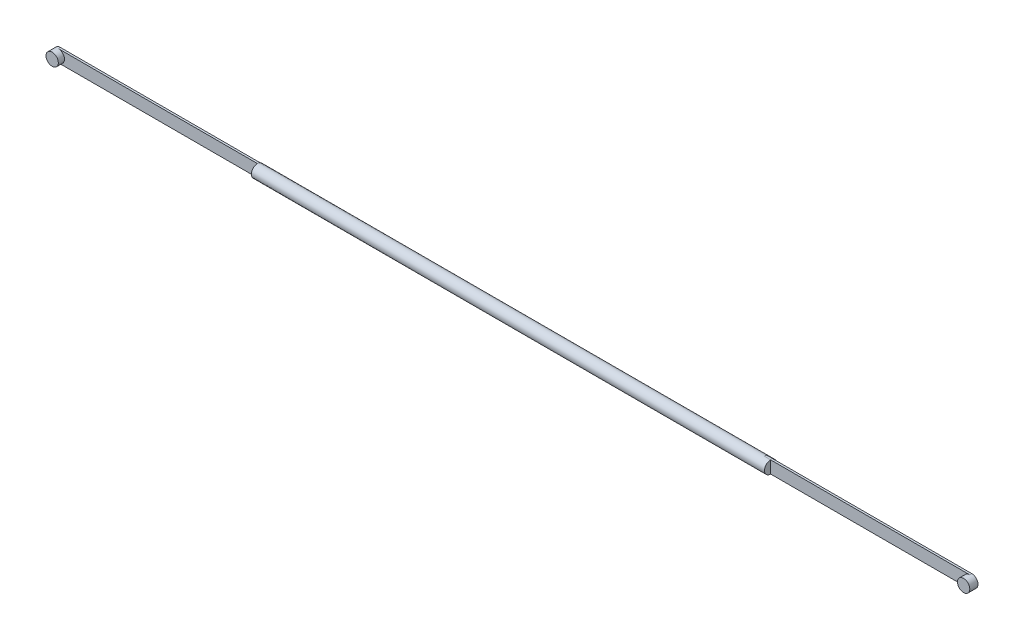
ISO-10303-21;
HEADER;
FILE_DESCRIPTION(('STEP AP214'),'2;1');
FILE_NAME('part.step','',(''),(''),'','','');
FILE_SCHEMA(('AUTOMOTIVE_DESIGN { 1 0 10303 214 1 1 1 1 }'));
ENDSEC;
DATA;
#1=APPLICATION_CONTEXT('core data for automotive mechanical design processes');
#2=APPLICATION_PROTOCOL_DEFINITION('international standard','automotive_design',2000,#1);
#3=PRODUCT_CONTEXT('',#1,'mechanical');
#4=PRODUCT('Part','Part','',(#3));
#5=PRODUCT_RELATED_PRODUCT_CATEGORY('part','',(#4));
#6=PRODUCT_DEFINITION_FORMATION('','',#4);
#7=PRODUCT_DEFINITION_CONTEXT('part definition',#1,'design');
#8=PRODUCT_DEFINITION('design','',#6,#7);
#9=PRODUCT_DEFINITION_SHAPE('','',#8);
#10=(LENGTH_UNIT() NAMED_UNIT(*) SI_UNIT(.MILLI.,.METRE.));
#11=(NAMED_UNIT(*) PLANE_ANGLE_UNIT() SI_UNIT($,.RADIAN.));
#12=(NAMED_UNIT(*) SI_UNIT($,.STERADIAN.) SOLID_ANGLE_UNIT());
#13=UNCERTAINTY_MEASURE_WITH_UNIT(LENGTH_MEASURE(1.E-05),#10,'distance_accuracy_value','');
#14=(GEOMETRIC_REPRESENTATION_CONTEXT(3) GLOBAL_UNCERTAINTY_ASSIGNED_CONTEXT((#13)) GLOBAL_UNIT_ASSIGNED_CONTEXT((#10,
#11,#12)) REPRESENTATION_CONTEXT('',''));
#15=CARTESIAN_POINT('',(0.,0.,0.));
#16=DIRECTION('',(0.,0.,1.));
#17=DIRECTION('',(1.,0.,0.));
#18=AXIS2_PLACEMENT_3D('',#15,#16,#17);
#19=CARTESIAN_POINT('',(-125.,0.,0.));
#20=DIRECTION('',(1.,0.,0.));
#21=DIRECTION('',(0.,1.,0.));
#22=AXIS2_PLACEMENT_3D('',#19,#20,#21);
#23=PLANE('',#22);
#24=DIRECTION('',(0.,-1.,0.));
#25=VECTOR('',#24,1.);
#26=CARTESIAN_POINT('',(-125.,0.,-1.));
#27=LINE('',#26,#25);
#28=CARTESIAN_POINT('',(-125.,2.82842712474632,-1.));
#29=VERTEX_POINT('',#28);
#30=CARTESIAN_POINT('',(-125.,-2.82842712474632,-1.));
#31=VERTEX_POINT('',#30);
#32=EDGE_CURVE('E234',#29,#31,#27,.T.);
#33=ORIENTED_EDGE('',*,*,#32,.F.);
#34=CARTESIAN_POINT('',(-125.,0.,0.));
#35=DIRECTION('',(-1.,0.,0.));
#36=DIRECTION('',(0.,-1.,0.));
#37=AXIS2_PLACEMENT_3D('',#34,#35,#36);
#38=CIRCLE('',#37,3.00000000000012);
#39=EDGE_CURVE('E192',#29,#31,#38,.T.);
#40=ORIENTED_EDGE('',*,*,#39,.T.);
#41=EDGE_LOOP('',(#33,#40));
#42=FACE_BOUND('',#41,.T.);
#43=ADVANCED_FACE('F47',(#42),#23,.F.);
#44=CARTESIAN_POINT('',(125.,0.,0.));
#45=DIRECTION('',(1.,0.,0.));
#46=DIRECTION('',(0.,1.,0.));
#47=AXIS2_PLACEMENT_3D('',#44,#45,#46);
#48=PLANE('',#47);
#49=CARTESIAN_POINT('',(125.,0.,0.));
#50=DIRECTION('',(-1.,0.,0.));
#51=DIRECTION('',(0.,-1.,0.));
#52=AXIS2_PLACEMENT_3D('',#49,#50,#51);
#53=CIRCLE('',#52,3.0000000000001);
#54=CARTESIAN_POINT('',(125.,2.82842712474633,-1.));
#55=VERTEX_POINT('',#54);
#56=CARTESIAN_POINT('',(125.,-2.82842712474628,-1.));
#57=VERTEX_POINT('',#56);
#58=EDGE_CURVE('E178',#55,#57,#53,.T.);
#59=ORIENTED_EDGE('',*,*,#58,.F.);
#60=DIRECTION('',(0.,-1.,0.));
#61=VECTOR('',#60,1.);
#62=CARTESIAN_POINT('',(125.,0.,-1.));
#63=LINE('',#62,#61);
#64=EDGE_CURVE('E189',#55,#57,#63,.T.);
#65=ORIENTED_EDGE('',*,*,#64,.T.);
#66=EDGE_LOOP('',(#59,#65));
#67=FACE_BOUND('',#66,.T.);
#68=ADVANCED_FACE('F262',(#67),#48,.T.);
#69=CARTESIAN_POINT('',(-125.,0.,0.));
#70=DIRECTION('',(-1.,0.,0.));
#71=DIRECTION('',(0.,-1.,0.));
#72=AXIS2_PLACEMENT_3D('',#69,#70,#71);
#73=CYLINDRICAL_SURFACE('',#72,3.00000000000011);
#74=CARTESIAN_POINT('',(-125.,-3.00000000000018,0.));
#75=VERTEX_POINT('',#74);
#76=CARTESIAN_POINT('',(-125.,3.00000000000018,0.));
#77=VERTEX_POINT('',#76);
#78=EDGE_CURVE('E183',#75,#77,#38,.T.);
#79=ORIENTED_EDGE('',*,*,#78,.F.);
#80=EDGE_CURVE('E187',#31,#75,#38,.T.);
#81=ORIENTED_EDGE('',*,*,#80,.F.);
#82=ORIENTED_EDGE('',*,*,#39,.F.);
#83=EDGE_CURVE('E188',#77,#29,#38,.T.);
#84=ORIENTED_EDGE('',*,*,#83,.F.);
#85=EDGE_LOOP('',(#79,#81,#82,#84));
#86=FACE_BOUND('',#85,.T.);
#87=DIRECTION('',(-1.,0.,0.));
#88=VECTOR('',#87,1.);
#89=CARTESIAN_POINT('',(-125.,2.82842712474631,-1.));
#90=LINE('',#89,#88);
#91=CARTESIAN_POINT('',(122.,2.82842712474634,-1.));
#92=VERTEX_POINT('',#91);
#93=EDGE_CURVE('E171',#55,#92,#90,.T.);
#94=ORIENTED_EDGE('',*,*,#93,.F.);
#95=ORIENTED_EDGE('',*,*,#58,.T.);
#96=DIRECTION('',(-1.,0.,0.));
#97=VECTOR('',#96,1.);
#98=CARTESIAN_POINT('',(-125.,-2.82842712474631,-1.));
#99=LINE('',#98,#97);
#100=CARTESIAN_POINT('',(122.,-2.82842712474628,-1.));
#101=VERTEX_POINT('',#100);
#102=EDGE_CURVE('E173',#101,#57,#99,.F.);
#103=ORIENTED_EDGE('',*,*,#102,.F.);
#104=CARTESIAN_POINT('',(122.,0.,0.));
#105=DIRECTION('',(-1.,0.,0.));
#106=DIRECTION('',(0.,0.,1.));
#107=AXIS2_PLACEMENT_3D('',#104,#105,#106);
#108=CIRCLE('',#107,3.00000000000011);
#109=CARTESIAN_POINT('',(122.,-3.00000000000019,0.));
#110=VERTEX_POINT('',#109);
#111=EDGE_CURVE('E175',#101,#110,#108,.T.);
#112=ORIENTED_EDGE('',*,*,#111,.T.);
#113=DIRECTION('',(1.,0.,0.));
#114=VECTOR('',#113,1.);
#115=CARTESIAN_POINT('',(0.,-3.00000000000019,0.));
#116=LINE('',#115,#114);
#117=CARTESIAN_POINT('',(125.,-3.00000000000007,0.));
#118=VERTEX_POINT('',#117);
#119=EDGE_CURVE('E154',#110,#118,#116,.T.);
#120=ORIENTED_EDGE('',*,*,#119,.T.);
#121=CARTESIAN_POINT('',(125.,3.00000000000016,0.));
#122=VERTEX_POINT('',#121);
#123=EDGE_CURVE('E180',#118,#122,#53,.T.);
#124=ORIENTED_EDGE('',*,*,#123,.T.);
#125=DIRECTION('',(1.,0.,0.));
#126=VECTOR('',#125,1.);
#127=CARTESIAN_POINT('',(0.,3.00000000000016,0.));
#128=LINE('',#127,#126);
#129=CARTESIAN_POINT('',(122.,3.00000000000016,0.));
#130=VERTEX_POINT('',#129);
#131=EDGE_CURVE('E199',#130,#122,#128,.T.);
#132=ORIENTED_EDGE('',*,*,#131,.F.);
#133=EDGE_CURVE('E179',#130,#92,#108,.T.);
#134=ORIENTED_EDGE('',*,*,#133,.T.);
#135=EDGE_LOOP('',(#94,#95,#103,#112,#120,#124,#132,#134));
#136=FACE_BOUND('',#135,.T.);
#137=ADVANCED_FACE('F255',(#86,#136),#73,.T.);
#138=DIRECTION('',(0.,-1.,0.));
#139=VECTOR('',#138,1.);
#140=CARTESIAN_POINT('',(125.,0.,0.));
#141=LINE('',#140,#139);
#142=EDGE_CURVE('E150',#122,#118,#141,.T.);
#143=ORIENTED_EDGE('',*,*,#142,.F.);
#144=ORIENTED_EDGE('',*,*,#123,.F.);
#145=EDGE_LOOP('',(#143,#144));
#146=FACE_BOUND('',#145,.T.);
#147=ADVANCED_FACE('F253',(#146),#48,.T.);
#148=ORIENTED_EDGE('',*,*,#78,.T.);
#149=DIRECTION('',(0.,-1.,0.));
#150=VECTOR('',#149,1.);
#151=CARTESIAN_POINT('',(-125.,0.,0.));
#152=LINE('',#151,#150);
#153=EDGE_CURVE('E186',#77,#75,#152,.T.);
#154=ORIENTED_EDGE('',*,*,#153,.T.);
#155=EDGE_LOOP('',(#148,#154));
#156=FACE_BOUND('',#155,.T.);
#157=ADVANCED_FACE('F266',(#156),#23,.F.);
#158=CARTESIAN_POINT('',(122.,0.,-1.));
#159=DIRECTION('',(-1.,0.,0.));
#160=DIRECTION('',(0.,0.,1.));
#161=AXIS2_PLACEMENT_3D('',#158,#159,#160);
#162=PLANE('',#161);
#163=ORIENTED_EDGE('',*,*,#133,.F.);
#164=DIRECTION('',(0.,0.,1.));
#165=VECTOR('',#164,1.);
#166=CARTESIAN_POINT('',(122.,3.00000000000016,-1.));
#167=LINE('',#166,#165);
#168=CARTESIAN_POINT('',(122.,3.00000000000016,-1.));
#169=VERTEX_POINT('',#168);
#170=EDGE_CURVE('E193',#169,#130,#167,.T.);
#171=ORIENTED_EDGE('',*,*,#170,.F.);
#172=DIRECTION('',(0.,-1.,0.));
#173=VECTOR('',#172,1.);
#174=CARTESIAN_POINT('',(122.,0.,-1.));
#175=LINE('',#174,#173);
#176=EDGE_CURVE('E204',#169,#92,#175,.T.);
#177=ORIENTED_EDGE('',*,*,#176,.T.);
#178=EDGE_LOOP('',(#163,#171,#177));
#179=FACE_BOUND('',#178,.T.);
#180=ADVANCED_FACE('F264',(#179),#162,.T.);
#181=CARTESIAN_POINT('',(0.,0.,-1.));
#182=DIRECTION('',(0.,0.,1.));
#183=DIRECTION('',(1.,0.,0.));
#184=AXIS2_PLACEMENT_3D('',#181,#182,#183);
#185=PLANE('',#184);
#186=DIRECTION('',(1.,0.,0.));
#187=VECTOR('',#186,1.);
#188=CARTESIAN_POINT('',(0.,3.00000000000016,-1.));
#189=LINE('',#188,#187);
#190=CARTESIAN_POINT('',(222.,3.00000000000017,-1.));
#191=VERTEX_POINT('',#190);
#192=EDGE_CURVE('E207',#169,#191,#189,.T.);
#193=ORIENTED_EDGE('',*,*,#192,.T.);
#194=CARTESIAN_POINT('',(222.,0.,-1.));
#195=DIRECTION('',(0.,0.,1.));
#196=DIRECTION('',(1.,0.,0.));
#197=AXIS2_PLACEMENT_3D('',#194,#195,#196);
#198=CIRCLE('',#197,3.00000000000017);
#199=CARTESIAN_POINT('',(222.,-3.00000000000017,-1.));
#200=VERTEX_POINT('',#199);
#201=EDGE_CURVE('E63',#191,#200,#198,.T.);
#202=ORIENTED_EDGE('',*,*,#201,.T.);
#203=DIRECTION('',(1.,0.,0.));
#204=VECTOR('',#203,1.);
#205=CARTESIAN_POINT('',(0.,-3.00000000000019,-1.));
#206=LINE('',#205,#204);
#207=CARTESIAN_POINT('',(122.,-3.00000000000019,-1.));
#208=VERTEX_POINT('',#207);
#209=EDGE_CURVE('E140',#208,#200,#206,.T.);
#210=ORIENTED_EDGE('',*,*,#209,.F.);
#211=EDGE_CURVE('E143',#101,#208,#175,.T.);
#212=ORIENTED_EDGE('',*,*,#211,.F.);
#213=ORIENTED_EDGE('',*,*,#102,.T.);
#214=ORIENTED_EDGE('',*,*,#64,.F.);
#215=ORIENTED_EDGE('',*,*,#93,.T.);
#216=ORIENTED_EDGE('',*,*,#176,.F.);
#217=EDGE_LOOP('',(#193,#202,#210,#212,#213,#214,#215,#216));
#218=FACE_BOUND('',#217,.T.);
#219=ADVANCED_FACE('F242',(#218),#185,.F.);
#220=CARTESIAN_POINT('',(0.,-3.00000000000019,-1.));
#221=DIRECTION('',(0.,-1.,0.));
#222=DIRECTION('',(0.,0.,-1.));
#223=AXIS2_PLACEMENT_3D('',#220,#221,#222);
#224=PLANE('',#223);
#225=ORIENTED_EDGE('',*,*,#119,.F.);
#226=DIRECTION('',(0.,0.,1.));
#227=VECTOR('',#226,1.);
#228=CARTESIAN_POINT('',(122.,-3.00000000000019,-1.));
#229=LINE('',#228,#227);
#230=EDGE_CURVE('E198',#208,#110,#229,.T.);
#231=ORIENTED_EDGE('',*,*,#230,.F.);
#232=ORIENTED_EDGE('',*,*,#209,.T.);
#233=DIRECTION('',(0.,0.,1.));
#234=VECTOR('',#233,1.);
#235=CARTESIAN_POINT('',(222.,-3.00000000000019,-1.));
#236=LINE('',#235,#234);
#237=CARTESIAN_POINT('',(222.,-3.00000000000017,0.));
#238=VERTEX_POINT('',#237);
#239=EDGE_CURVE('E132',#200,#238,#236,.T.);
#240=ORIENTED_EDGE('',*,*,#239,.T.);
#241=EDGE_CURVE('E136',#118,#238,#116,.T.);
#242=ORIENTED_EDGE('',*,*,#241,.F.);
#243=EDGE_LOOP('',(#225,#231,#232,#240,#242));
#244=FACE_BOUND('',#243,.T.);
#245=ADVANCED_FACE('F135',(#244),#224,.T.);
#246=ORIENTED_EDGE('',*,*,#111,.F.);
#247=ORIENTED_EDGE('',*,*,#211,.T.);
#248=ORIENTED_EDGE('',*,*,#230,.T.);
#249=EDGE_LOOP('',(#246,#247,#248));
#250=FACE_BOUND('',#249,.T.);
#251=ADVANCED_FACE('F258',(#250),#162,.T.);
#252=CARTESIAN_POINT('',(0.,3.00000000000016,-1.));
#253=DIRECTION('',(0.,-1.,0.));
#254=DIRECTION('',(0.,0.,-1.));
#255=AXIS2_PLACEMENT_3D('',#252,#253,#254);
#256=PLANE('',#255);
#257=ORIENTED_EDGE('',*,*,#131,.T.);
#258=CARTESIAN_POINT('',(222.,3.00000000000016,0.));
#259=VERTEX_POINT('',#258);
#260=EDGE_CURVE('E197',#122,#259,#128,.T.);
#261=ORIENTED_EDGE('',*,*,#260,.T.);
#262=DIRECTION('',(0.,0.,1.));
#263=VECTOR('',#262,1.);
#264=CARTESIAN_POINT('',(222.,3.00000000000016,-1.));
#265=LINE('',#264,#263);
#266=EDGE_CURVE('E159',#191,#259,#265,.T.);
#267=ORIENTED_EDGE('',*,*,#266,.F.);
#268=ORIENTED_EDGE('',*,*,#192,.F.);
#269=ORIENTED_EDGE('',*,*,#170,.T.);
#270=EDGE_LOOP('',(#257,#261,#267,#268,#269));
#271=FACE_BOUND('',#270,.T.);
#272=ADVANCED_FACE('F247',(#271),#256,.F.);
#273=CARTESIAN_POINT('',(0.,0.,0.));
#274=DIRECTION('',(0.,0.,1.));
#275=DIRECTION('',(1.,0.,0.));
#276=AXIS2_PLACEMENT_3D('',#273,#274,#275);
#277=PLANE('',#276);
#278=CARTESIAN_POINT('',(222.,0.,0.));
#279=DIRECTION('',(0.,0.,1.));
#280=DIRECTION('',(1.,0.,0.));
#281=AXIS2_PLACEMENT_3D('',#278,#279,#280);
#282=CIRCLE('',#281,3.00000000000017);
#283=EDGE_CURVE('E147',#259,#238,#282,.T.);
#284=ORIENTED_EDGE('',*,*,#283,.F.);
#285=ORIENTED_EDGE('',*,*,#260,.F.);
#286=ORIENTED_EDGE('',*,*,#142,.T.);
#287=ORIENTED_EDGE('',*,*,#241,.T.);
#288=EDGE_LOOP('',(#284,#285,#286,#287));
#289=FACE_BOUND('',#288,.T.);
#290=ADVANCED_FACE('F146',(#289),#277,.T.);
#291=CARTESIAN_POINT('',(-125.,0.,-1.));
#292=DIRECTION('',(-1.,0.,0.));
#293=DIRECTION('',(0.,0.,1.));
#294=AXIS2_PLACEMENT_3D('',#291,#292,#293);
#295=PLANE('',#294);
#296=DIRECTION('',(0.,0.,1.));
#297=VECTOR('',#296,1.);
#298=CARTESIAN_POINT('',(-125.,3.00000000000018,-1.));
#299=LINE('',#298,#297);
#300=CARTESIAN_POINT('',(-125.,3.00000000000018,-1.));
#301=VERTEX_POINT('',#300);
#302=EDGE_CURVE('E152',#301,#77,#299,.T.);
#303=ORIENTED_EDGE('',*,*,#302,.T.);
#304=ORIENTED_EDGE('',*,*,#83,.T.);
#305=EDGE_CURVE('E231',#301,#29,#27,.T.);
#306=ORIENTED_EDGE('',*,*,#305,.F.);
#307=EDGE_LOOP('',(#303,#304,#306));
#308=FACE_BOUND('',#307,.T.);
#309=ADVANCED_FACE('F290',(#308),#295,.F.);
#310=CARTESIAN_POINT('',(-125.,-3.00000000000018,-1.));
#311=VERTEX_POINT('',#310);
#312=EDGE_CURVE('E225',#31,#311,#27,.T.);
#313=ORIENTED_EDGE('',*,*,#312,.F.);
#314=ORIENTED_EDGE('',*,*,#80,.T.);
#315=DIRECTION('',(0.,0.,1.));
#316=VECTOR('',#315,1.);
#317=CARTESIAN_POINT('',(-125.,-3.00000000000018,-1.));
#318=LINE('',#317,#316);
#319=EDGE_CURVE('E209',#311,#75,#318,.T.);
#320=ORIENTED_EDGE('',*,*,#319,.F.);
#321=EDGE_LOOP('',(#313,#314,#320));
#322=FACE_BOUND('',#321,.T.);
#323=ADVANCED_FACE('F295',(#322),#295,.F.);
#324=CARTESIAN_POINT('',(0.,-3.00000000000016,-1.));
#325=DIRECTION('',(0.,1.,0.));
#326=DIRECTION('',(-1.,0.,0.));
#327=AXIS2_PLACEMENT_3D('',#324,#325,#326);
#328=PLANE('',#327);
#329=DIRECTION('',(-1.,0.,0.));
#330=VECTOR('',#329,1.);
#331=CARTESIAN_POINT('',(0.,-3.00000000000016,0.));
#332=LINE('',#331,#330);
#333=CARTESIAN_POINT('',(-222.,-3.00000000000019,0.));
#334=VERTEX_POINT('',#333);
#335=EDGE_CURVE('E213',#75,#334,#332,.T.);
#336=ORIENTED_EDGE('',*,*,#335,.T.);
#337=DIRECTION('',(0.,0.,1.));
#338=VECTOR('',#337,1.);
#339=CARTESIAN_POINT('',(-222.,-3.00000000000019,-1.));
#340=LINE('',#339,#338);
#341=CARTESIAN_POINT('',(-222.,-3.00000000000017,-1.));
#342=VERTEX_POINT('',#341);
#343=EDGE_CURVE('E170',#342,#334,#340,.T.);
#344=ORIENTED_EDGE('',*,*,#343,.F.);
#345=DIRECTION('',(-1.,0.,0.));
#346=VECTOR('',#345,1.);
#347=CARTESIAN_POINT('',(0.,-3.00000000000016,-1.));
#348=LINE('',#347,#346);
#349=EDGE_CURVE('E219',#311,#342,#348,.T.);
#350=ORIENTED_EDGE('',*,*,#349,.F.);
#351=ORIENTED_EDGE('',*,*,#319,.T.);
#352=EDGE_LOOP('',(#336,#344,#350,#351));
#353=FACE_BOUND('',#352,.T.);
#354=ADVANCED_FACE('F299',(#353),#328,.F.);
#355=CARTESIAN_POINT('',(0.,3.00000000000019,-1.));
#356=DIRECTION('',(0.,1.,0.));
#357=DIRECTION('',(-1.,0.,0.));
#358=AXIS2_PLACEMENT_3D('',#355,#356,#357);
#359=PLANE('',#358);
#360=DIRECTION('',(-1.,0.,0.));
#361=VECTOR('',#360,1.);
#362=CARTESIAN_POINT('',(0.,3.00000000000019,0.));
#363=LINE('',#362,#361);
#364=CARTESIAN_POINT('',(-222.,3.00000000000017,0.));
#365=VERTEX_POINT('',#364);
#366=EDGE_CURVE('E222',#77,#365,#363,.T.);
#367=ORIENTED_EDGE('',*,*,#366,.F.);
#368=ORIENTED_EDGE('',*,*,#302,.F.);
#369=DIRECTION('',(-1.,0.,0.));
#370=VECTOR('',#369,1.);
#371=CARTESIAN_POINT('',(0.,3.00000000000019,-1.));
#372=LINE('',#371,#370);
#373=CARTESIAN_POINT('',(-222.,3.00000000000017,-1.));
#374=VERTEX_POINT('',#373);
#375=EDGE_CURVE('E212',#301,#374,#372,.T.);
#376=ORIENTED_EDGE('',*,*,#375,.T.);
#377=DIRECTION('',(0.,0.,1.));
#378=VECTOR('',#377,1.);
#379=CARTESIAN_POINT('',(-222.,3.00000000000016,-1.));
#380=LINE('',#379,#378);
#381=EDGE_CURVE('E216',#374,#365,#380,.T.);
#382=ORIENTED_EDGE('',*,*,#381,.T.);
#383=EDGE_LOOP('',(#367,#368,#376,#382));
#384=FACE_BOUND('',#383,.T.);
#385=ADVANCED_FACE('F301',(#384),#359,.T.);
#386=CARTESIAN_POINT('',(0.,0.,-1.));
#387=DIRECTION('',(0.,0.,1.));
#388=DIRECTION('',(1.,0.,0.));
#389=AXIS2_PLACEMENT_3D('',#386,#387,#388);
#390=PLANE('',#389);
#391=ORIENTED_EDGE('',*,*,#349,.T.);
#392=CARTESIAN_POINT('',(-222.,0.,-1.));
#393=DIRECTION('',(0.,0.,1.));
#394=DIRECTION('',(1.,0.,0.));
#395=AXIS2_PLACEMENT_3D('',#392,#393,#394);
#396=CIRCLE('',#395,3.00000000000017);
#397=EDGE_CURVE('E235',#342,#374,#396,.T.);
#398=ORIENTED_EDGE('',*,*,#397,.T.);
#399=ORIENTED_EDGE('',*,*,#375,.F.);
#400=ORIENTED_EDGE('',*,*,#305,.T.);
#401=ORIENTED_EDGE('',*,*,#32,.T.);
#402=ORIENTED_EDGE('',*,*,#312,.T.);
#403=EDGE_LOOP('',(#391,#398,#399,#400,#401,#402));
#404=FACE_BOUND('',#403,.T.);
#405=ADVANCED_FACE('F306',(#404),#390,.F.);
#406=CARTESIAN_POINT('',(0.,0.,0.));
#407=DIRECTION('',(0.,0.,1.));
#408=DIRECTION('',(1.,0.,0.));
#409=AXIS2_PLACEMENT_3D('',#406,#407,#408);
#410=PLANE('',#409);
#411=CARTESIAN_POINT('',(-222.,0.,0.));
#412=DIRECTION('',(0.,0.,1.));
#413=DIRECTION('',(1.,0.,0.));
#414=AXIS2_PLACEMENT_3D('',#411,#412,#413);
#415=CIRCLE('',#414,3.00000000000017);
#416=EDGE_CURVE('E163',#334,#365,#415,.T.);
#417=ORIENTED_EDGE('',*,*,#416,.F.);
#418=ORIENTED_EDGE('',*,*,#335,.F.);
#419=ORIENTED_EDGE('',*,*,#153,.F.);
#420=ORIENTED_EDGE('',*,*,#366,.T.);
#421=EDGE_LOOP('',(#417,#418,#419,#420));
#422=FACE_BOUND('',#421,.T.);
#423=ADVANCED_FACE('F308',(#422),#410,.T.);
#424=CARTESIAN_POINT('',(-222.,0.,-5.));
#425=DIRECTION('',(0.,0.,1.));
#426=DIRECTION('',(1.,0.,0.));
#427=AXIS2_PLACEMENT_3D('',#424,#425,#426);
#428=CYLINDRICAL_SURFACE('',#427,3.00000000000017);
#429=CARTESIAN_POINT('',(-222.,0.,3.00000000000012));
#430=DIRECTION('',(0.,0.,-1.));
#431=DIRECTION('',(-1.,0.,0.));
#432=AXIS2_PLACEMENT_3D('',#429,#430,#431);
#433=CIRCLE('',#432,3.00000000000017);
#434=CARTESIAN_POINT('',(-225.,0.,3.00000000000012));
#435=VERTEX_POINT('',#434);
#436=EDGE_CURVE('E224',#435,#435,#433,.T.);
#437=ORIENTED_EDGE('',*,*,#436,.T.);
#438=EDGE_LOOP('',(#437));
#439=FACE_BOUND('',#438,.T.);
#440=ORIENTED_EDGE('',*,*,#381,.F.);
#441=CARTESIAN_POINT('',(-222.,0.,-1.));
#442=DIRECTION('',(0.,0.,1.));
#443=DIRECTION('',(1.,0.,0.));
#444=AXIS2_PLACEMENT_3D('',#441,#442,#443);
#445=CIRCLE('',#444,3.00000000000017);
#446=EDGE_CURVE('E167',#374,#342,#445,.T.);
#447=ORIENTED_EDGE('',*,*,#446,.T.);
#448=ORIENTED_EDGE('',*,*,#343,.T.);
#449=ORIENTED_EDGE('',*,*,#416,.T.);
#450=EDGE_LOOP('',(#440,#447,#448,#449));
#451=FACE_BOUND('',#450,.T.);
#452=ADVANCED_FACE('F311',(#439,#451),#428,.T.);
#453=CARTESIAN_POINT('',(-222.,0.,3.00000000000012));
#454=DIRECTION('',(0.,0.,-1.));
#455=DIRECTION('',(-1.,0.,0.));
#456=AXIS2_PLACEMENT_3D('',#453,#454,#455);
#457=PLANE('',#456);
#458=ORIENTED_EDGE('',*,*,#436,.F.);
#459=EDGE_LOOP('',(#458));
#460=FACE_BOUND('',#459,.T.);
#461=ADVANCED_FACE('F318',(#460),#457,.F.);
#462=CARTESIAN_POINT('',(-222.,0.,-1.));
#463=DIRECTION('',(0.,1.,0.));
#464=DIRECTION('',(-1.,0.,0.));
#465=AXIS2_PLACEMENT_3D('',#462,#463,#464);
#466=SPHERICAL_SURFACE('',#465,3.00000000000017);
#467=CARTESIAN_POINT('',(-222.,0.,-1.));
#468=DIRECTION('',(0.,0.,1.));
#469=DIRECTION('',(1.,0.,0.));
#470=AXIS2_PLACEMENT_3D('',#467,#468,#469);
#471=SPHERICAL_SURFACE('',#470,3.00000000000017);
#472=ORIENTED_EDGE('',*,*,#397,.F.);
#473=ORIENTED_EDGE('',*,*,#446,.F.);
#474=EDGE_LOOP('',(#472,#473));
#475=FACE_BOUND('',#474,.T.);
#476=ADVANCED_FACE('F322',(#475),#471,.F.);
#477=CARTESIAN_POINT('',(222.,0.,-5.));
#478=DIRECTION('',(0.,0.,1.));
#479=DIRECTION('',(1.,0.,0.));
#480=AXIS2_PLACEMENT_3D('',#477,#478,#479);
#481=CYLINDRICAL_SURFACE('',#480,3.00000000000017);
#482=CARTESIAN_POINT('',(222.,0.,-1.));
#483=DIRECTION('',(0.,0.,1.));
#484=DIRECTION('',(1.,0.,0.));
#485=AXIS2_PLACEMENT_3D('',#482,#483,#484);
#486=CIRCLE('',#485,3.00000000000017);
#487=EDGE_CURVE('E11',#191,#200,#486,.F.);
#488=ORIENTED_EDGE('',*,*,#487,.F.);
#489=ORIENTED_EDGE('',*,*,#266,.T.);
#490=ORIENTED_EDGE('',*,*,#283,.T.);
#491=ORIENTED_EDGE('',*,*,#239,.F.);
#492=EDGE_LOOP('',(#488,#489,#490,#491));
#493=FACE_BOUND('',#492,.T.);
#494=CARTESIAN_POINT('',(222.,0.,3.00000000000012));
#495=DIRECTION('',(0.,0.,1.));
#496=DIRECTION('',(1.,0.,0.));
#497=AXIS2_PLACEMENT_3D('',#494,#495,#496);
#498=CIRCLE('',#497,3.00000000000017);
#499=CARTESIAN_POINT('',(225.,0.,3.00000000000012));
#500=VERTEX_POINT('',#499);
#501=EDGE_CURVE('E55',#500,#500,#498,.T.);
#502=ORIENTED_EDGE('',*,*,#501,.F.);
#503=EDGE_LOOP('',(#502));
#504=FACE_BOUND('',#503,.T.);
#505=ADVANCED_FACE('F156',(#493,#504),#481,.T.);
#506=CARTESIAN_POINT('',(222.,0.,3.00000000000012));
#507=DIRECTION('',(0.,0.,-1.));
#508=DIRECTION('',(1.,0.,0.));
#509=AXIS2_PLACEMENT_3D('',#506,#507,#508);
#510=PLANE('',#509);
#511=ORIENTED_EDGE('',*,*,#501,.T.);
#512=EDGE_LOOP('',(#511));
#513=FACE_BOUND('',#512,.T.);
#514=ADVANCED_FACE('F327',(#513),#510,.F.);
#515=CARTESIAN_POINT('',(222.,0.,-1.));
#516=DIRECTION('',(0.,1.,0.));
#517=DIRECTION('',(-1.,0.,0.));
#518=AXIS2_PLACEMENT_3D('',#515,#516,#517);
#519=SPHERICAL_SURFACE('',#518,3.00000000000017);
#520=CARTESIAN_POINT('',(222.,0.,-1.));
#521=DIRECTION('',(0.,0.,1.));
#522=DIRECTION('',(1.,0.,0.));
#523=AXIS2_PLACEMENT_3D('',#520,#521,#522);
#524=SPHERICAL_SURFACE('',#523,3.00000000000017);
#525=ORIENTED_EDGE('',*,*,#201,.F.);
#526=ORIENTED_EDGE('',*,*,#487,.T.);
#527=EDGE_LOOP('',(#525,#526));
#528=FACE_BOUND('',#527,.T.);
#529=ADVANCED_FACE('F49',(#528),#524,.F.);
#530=CLOSED_SHELL('',(#43,#68,#137,#147,#157,#180,#219,#245,#251,#272,#290,#309,#323,#354,#385,
#405,#423,#452,#461,#476,#505,#514,#529));
#531=MANIFOLD_SOLID_BREP('B2',#530);
#532=ADVANCED_BREP_SHAPE_REPRESENTATION('',(#18,#531),#14);
#533=SHAPE_DEFINITION_REPRESENTATION(#9,#532);
ENDSEC;
END-ISO-10303-21;
